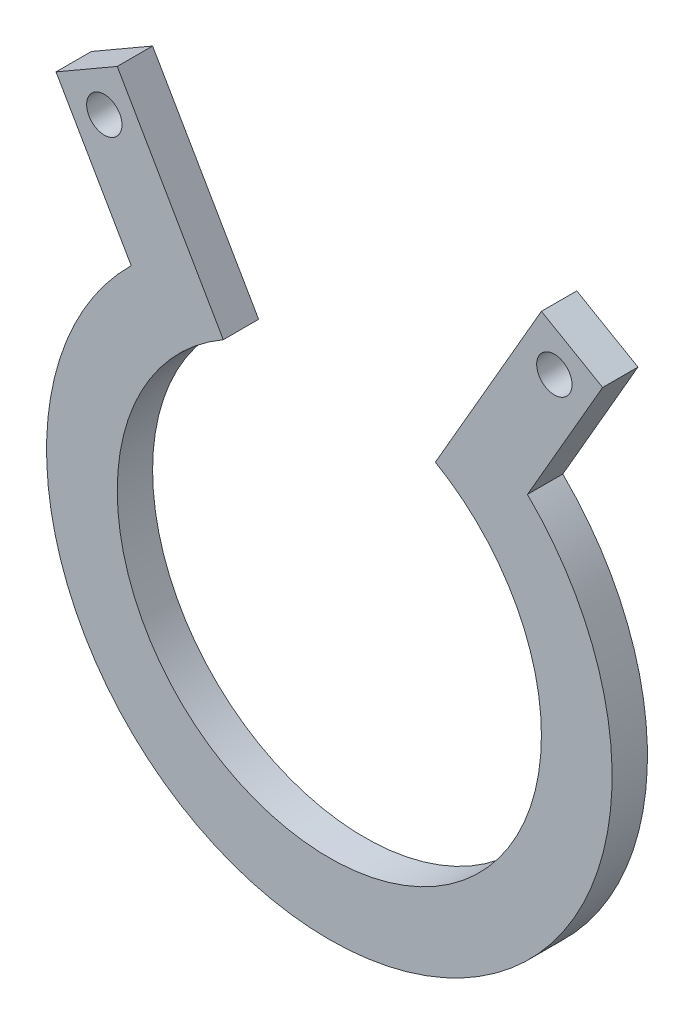
ISO-10303-21;
HEADER;
FILE_DESCRIPTION(('STEP AP214'),'2;1');
FILE_NAME('part.step','',(''),(''),'','','');
FILE_SCHEMA(('AUTOMOTIVE_DESIGN { 1 0 10303 214 1 1 1 1 }'));
ENDSEC;
DATA;
#1=APPLICATION_CONTEXT('core data for automotive mechanical design processes');
#2=APPLICATION_PROTOCOL_DEFINITION('international standard','automotive_design',2000,#1);
#3=PRODUCT_CONTEXT('',#1,'mechanical');
#4=PRODUCT('Part','Part','',(#3));
#5=PRODUCT_RELATED_PRODUCT_CATEGORY('part','',(#4));
#6=PRODUCT_DEFINITION_FORMATION('','',#4);
#7=PRODUCT_DEFINITION_CONTEXT('part definition',#1,'design');
#8=PRODUCT_DEFINITION('design','',#6,#7);
#9=PRODUCT_DEFINITION_SHAPE('','',#8);
#10=(LENGTH_UNIT() NAMED_UNIT(*) SI_UNIT(.MILLI.,.METRE.));
#11=(NAMED_UNIT(*) PLANE_ANGLE_UNIT() SI_UNIT($,.RADIAN.));
#12=(NAMED_UNIT(*) SI_UNIT($,.STERADIAN.) SOLID_ANGLE_UNIT());
#13=UNCERTAINTY_MEASURE_WITH_UNIT(LENGTH_MEASURE(1.E-05),#10,'distance_accuracy_value','');
#14=(GEOMETRIC_REPRESENTATION_CONTEXT(3) GLOBAL_UNCERTAINTY_ASSIGNED_CONTEXT((#13)) GLOBAL_UNIT_ASSIGNED_CONTEXT((#10,
#11,#12)) REPRESENTATION_CONTEXT('',''));
#15=CARTESIAN_POINT('',(0.,0.,0.));
#16=DIRECTION('',(0.,0.,1.));
#17=DIRECTION('',(1.,0.,0.));
#18=AXIS2_PLACEMENT_3D('',#15,#16,#17);
#19=CARTESIAN_POINT('',(0.,0.,3.175));
#20=DIRECTION('',(0.,0.,-1.));
#21=DIRECTION('',(-1.,0.,0.));
#22=AXIS2_PLACEMENT_3D('',#19,#20,#21);
#23=CYLINDRICAL_SURFACE('',#22,25.4);
#24=DIRECTION('',(0.,0.,1.));
#25=VECTOR('',#24,1.);
#26=CARTESIAN_POINT('',(17.7959834382398,18.1235474856855,-19.0153092118336));
#27=LINE('',#26,#25);
#28=CARTESIAN_POINT('',(17.7959834382398,18.1235474856855,0.));
#29=VERTEX_POINT('',#28);
#30=CARTESIAN_POINT('',(17.7959834382398,18.1235474856855,3.175));
#31=VERTEX_POINT('',#30);
#32=EDGE_CURVE('E64',#29,#31,#27,.T.);
#33=ORIENTED_EDGE('',*,*,#32,.T.);
#34=CARTESIAN_POINT('',(0.,0.,3.175));
#35=DIRECTION('',(0.,0.,1.));
#36=DIRECTION('',(1.,0.,0.));
#37=AXIS2_PLACEMENT_3D('',#34,#35,#36);
#38=CIRCLE('',#37,25.4);
#39=CARTESIAN_POINT('',(-17.7959834382398,18.1235474856855,3.175));
#40=VERTEX_POINT('',#39);
#41=EDGE_CURVE('E56',#40,#31,#38,.T.);
#42=ORIENTED_EDGE('',*,*,#41,.F.);
#43=DIRECTION('',(0.,0.,1.));
#44=VECTOR('',#43,1.);
#45=CARTESIAN_POINT('',(-17.7959834382398,18.1235474856855,-19.0153092118336));
#46=LINE('',#45,#44);
#47=CARTESIAN_POINT('',(-17.7959834382398,18.1235474856855,0.));
#48=VERTEX_POINT('',#47);
#49=EDGE_CURVE('E144',#48,#40,#46,.T.);
#50=ORIENTED_EDGE('',*,*,#49,.F.);
#51=CARTESIAN_POINT('',(0.,0.,0.));
#52=DIRECTION('',(0.,0.,1.));
#53=DIRECTION('',(1.,0.,0.));
#54=AXIS2_PLACEMENT_3D('',#51,#52,#53);
#55=CIRCLE('',#54,25.4);
#56=EDGE_CURVE('E69',#48,#29,#55,.T.);
#57=ORIENTED_EDGE('',*,*,#56,.T.);
#58=EDGE_LOOP('',(#33,#42,#50,#57));
#59=FACE_BOUND('',#58,.T.);
#60=ADVANCED_FACE('F48',(#59),#23,.T.);
#61=CARTESIAN_POINT('',(0.,0.,3.175));
#62=DIRECTION('',(0.,0.,-1.));
#63=DIRECTION('',(-1.,0.,0.));
#64=AXIS2_PLACEMENT_3D('',#61,#62,#63);
#65=CYLINDRICAL_SURFACE('',#64,19.05);
#66=DIRECTION('',(0.,0.,-1.));
#67=VECTOR('',#66,1.);
#68=CARTESIAN_POINT('',(9.52500000000003,16.4977839420935,3.175));
#69=LINE('',#68,#67);
#70=CARTESIAN_POINT('',(9.52500000000003,16.4977839420935,0.));
#71=VERTEX_POINT('',#70);
#72=CARTESIAN_POINT('',(9.52500000000002,16.4977839420935,3.175));
#73=VERTEX_POINT('',#72);
#74=EDGE_CURVE('E131',#71,#73,#69,.F.);
#75=ORIENTED_EDGE('',*,*,#74,.F.);
#76=CARTESIAN_POINT('',(0.,0.,0.));
#77=DIRECTION('',(0.,0.,1.));
#78=DIRECTION('',(1.,0.,0.));
#79=AXIS2_PLACEMENT_3D('',#76,#77,#78);
#80=CIRCLE('',#79,19.05);
#81=CARTESIAN_POINT('',(-9.52500000000003,16.4977839420935,0.));
#82=VERTEX_POINT('',#81);
#83=EDGE_CURVE('E51',#82,#71,#80,.T.);
#84=ORIENTED_EDGE('',*,*,#83,.F.);
#85=DIRECTION('',(0.,0.,-1.));
#86=VECTOR('',#85,1.);
#87=CARTESIAN_POINT('',(-9.52500000000003,16.4977839420935,3.175));
#88=LINE('',#87,#86);
#89=CARTESIAN_POINT('',(-9.52500000000003,16.4977839420935,3.175));
#90=VERTEX_POINT('',#89);
#91=EDGE_CURVE('E125',#90,#82,#88,.T.);
#92=ORIENTED_EDGE('',*,*,#91,.F.);
#93=CARTESIAN_POINT('',(0.,0.,3.175));
#94=DIRECTION('',(0.,0.,1.));
#95=DIRECTION('',(1.,0.,0.));
#96=AXIS2_PLACEMENT_3D('',#93,#94,#95);
#97=CIRCLE('',#96,19.05);
#98=EDGE_CURVE('E13',#90,#73,#97,.T.);
#99=ORIENTED_EDGE('',*,*,#98,.T.);
#100=EDGE_LOOP('',(#75,#84,#92,#99));
#101=FACE_BOUND('',#100,.T.);
#102=ADVANCED_FACE('F134',(#101),#65,.F.);
#103=CARTESIAN_POINT('',(0.,0.,3.175));
#104=DIRECTION('',(0.,0.,1.));
#105=DIRECTION('',(1.,0.,0.));
#106=AXIS2_PLACEMENT_3D('',#103,#104,#105);
#107=PLANE('',#106);
#108=DIRECTION('',(-0.500000000000001,-0.866025403784438,0.));
#109=VECTOR('',#108,1.);
#110=CARTESIAN_POINT('',(0.,0.,3.175));
#111=LINE('',#110,#109);
#112=CARTESIAN_POINT('',(19.0500000000001,32.9955678841871,3.175));
#113=VERTEX_POINT('',#112);
#114=EDGE_CURVE('E177',#113,#73,#111,.T.);
#115=ORIENTED_EDGE('',*,*,#114,.T.);
#116=ORIENTED_EDGE('',*,*,#98,.F.);
#117=DIRECTION('',(-0.500000000000001,0.866025403784438,0.));
#118=VECTOR('',#117,1.);
#119=CARTESIAN_POINT('',(0.,0.,3.175));
#120=LINE('',#119,#118);
#121=CARTESIAN_POINT('',(-19.0500000000001,32.9955678841871,3.175));
#122=VERTEX_POINT('',#121);
#123=EDGE_CURVE('E128',#90,#122,#120,.T.);
#124=ORIENTED_EDGE('',*,*,#123,.T.);
#125=DIRECTION('',(-0.866025403784438,-0.500000000000001,0.));
#126=VECTOR('',#125,1.);
#127=CARTESIAN_POINT('',(-19.05,32.9955678841871,3.175));
#128=LINE('',#127,#126);
#129=CARTESIAN_POINT('',(-24.5492613140312,29.8205678841871,3.175));
#130=VERTEX_POINT('',#129);
#131=EDGE_CURVE('E147',#122,#130,#128,.T.);
#132=ORIENTED_EDGE('',*,*,#131,.T.);
#133=DIRECTION('',(0.500000000000001,-0.866025403784438,0.));
#134=VECTOR('',#133,1.);
#135=CARTESIAN_POINT('',(-5.49926131403119,-3.17500000000001,3.175));
#136=LINE('',#135,#134);
#137=EDGE_CURVE('E157',#130,#40,#136,.T.);
#138=ORIENTED_EDGE('',*,*,#137,.T.);
#139=ORIENTED_EDGE('',*,*,#41,.T.);
#140=DIRECTION('',(-0.500000000000001,-0.866025403784438,0.));
#141=VECTOR('',#140,1.);
#142=CARTESIAN_POINT('',(5.49926131403119,-3.17500000000001,3.175));
#143=LINE('',#142,#141);
#144=CARTESIAN_POINT('',(24.5492613140312,29.8205678841871,3.175));
#145=VERTEX_POINT('',#144);
#146=EDGE_CURVE('E178',#145,#31,#143,.T.);
#147=ORIENTED_EDGE('',*,*,#146,.F.);
#148=DIRECTION('',(0.866025403784438,-0.500000000000001,0.));
#149=VECTOR('',#148,1.);
#150=CARTESIAN_POINT('',(19.05,32.9955678841871,3.175));
#151=LINE('',#150,#149);
#152=EDGE_CURVE('E170',#113,#145,#151,.T.);
#153=ORIENTED_EDGE('',*,*,#152,.F.);
#154=EDGE_LOOP('',(#115,#116,#124,#132,#138,#139,#147,#153));
#155=FACE_BOUND('',#154,.T.);
#156=CARTESIAN_POINT('',(-20.2121306570156,28.6584372271715,3.175));
#157=DIRECTION('',(0.,0.,1.));
#158=DIRECTION('',(1.,0.,0.));
#159=AXIS2_PLACEMENT_3D('',#156,#157,#158);
#160=CIRCLE('',#159,1.58749999999998);
#161=CARTESIAN_POINT('',(-18.6246306570157,28.6584372271715,3.175));
#162=VERTEX_POINT('',#161);
#163=EDGE_CURVE('E148',#162,#162,#160,.T.);
#164=ORIENTED_EDGE('',*,*,#163,.F.);
#165=EDGE_LOOP('',(#164));
#166=FACE_BOUND('',#165,.T.);
#167=CARTESIAN_POINT('',(20.2121306570156,28.6584372271715,3.175));
#168=DIRECTION('',(0.,0.,1.));
#169=DIRECTION('',(1.,0.,0.));
#170=AXIS2_PLACEMENT_3D('',#167,#168,#169);
#171=CIRCLE('',#170,1.58749999999998);
#172=CARTESIAN_POINT('',(21.7996306570156,28.6584372271715,3.175));
#173=VERTEX_POINT('',#172);
#174=EDGE_CURVE('E164',#173,#173,#171,.F.);
#175=ORIENTED_EDGE('',*,*,#174,.T.);
#176=EDGE_LOOP('',(#175));
#177=FACE_BOUND('',#176,.T.);
#178=ADVANCED_FACE('F192',(#155,#166,#177),#107,.T.);
#179=CARTESIAN_POINT('',(0.,0.,0.));
#180=DIRECTION('',(0.,0.,1.));
#181=DIRECTION('',(1.,0.,0.));
#182=AXIS2_PLACEMENT_3D('',#179,#180,#181);
#183=PLANE('',#182);
#184=ORIENTED_EDGE('',*,*,#83,.T.);
#185=DIRECTION('',(0.500000000000001,0.866025403784438,0.));
#186=VECTOR('',#185,1.);
#187=CARTESIAN_POINT('',(0.,0.,0.));
#188=LINE('',#187,#186);
#189=CARTESIAN_POINT('',(19.0500000000001,32.9955678841871,0.));
#190=VERTEX_POINT('',#189);
#191=EDGE_CURVE('E143',#71,#190,#188,.T.);
#192=ORIENTED_EDGE('',*,*,#191,.T.);
#193=DIRECTION('',(-0.866025403784438,0.500000000000001,0.));
#194=VECTOR('',#193,1.);
#195=CARTESIAN_POINT('',(19.05,32.9955678841871,0.));
#196=LINE('',#195,#194);
#197=CARTESIAN_POINT('',(24.5492613140312,29.8205678841871,0.));
#198=VERTEX_POINT('',#197);
#199=EDGE_CURVE('E171',#198,#190,#196,.T.);
#200=ORIENTED_EDGE('',*,*,#199,.F.);
#201=DIRECTION('',(0.500000000000001,0.866025403784438,0.));
#202=VECTOR('',#201,1.);
#203=CARTESIAN_POINT('',(5.49926131403119,-3.17500000000001,0.));
#204=LINE('',#203,#202);
#205=EDGE_CURVE('E166',#29,#198,#204,.T.);
#206=ORIENTED_EDGE('',*,*,#205,.F.);
#207=ORIENTED_EDGE('',*,*,#56,.F.);
#208=DIRECTION('',(-0.500000000000001,0.866025403784438,0.));
#209=VECTOR('',#208,1.);
#210=CARTESIAN_POINT('',(-5.49926131403119,-3.17500000000001,0.));
#211=LINE('',#210,#209);
#212=CARTESIAN_POINT('',(-24.5492613140312,29.8205678841871,0.));
#213=VERTEX_POINT('',#212);
#214=EDGE_CURVE('E122',#48,#213,#211,.T.);
#215=ORIENTED_EDGE('',*,*,#214,.T.);
#216=DIRECTION('',(0.866025403784438,0.500000000000001,0.));
#217=VECTOR('',#216,1.);
#218=CARTESIAN_POINT('',(-19.05,32.9955678841871,0.));
#219=LINE('',#218,#217);
#220=CARTESIAN_POINT('',(-19.0500000000001,32.9955678841871,0.));
#221=VERTEX_POINT('',#220);
#222=EDGE_CURVE('E119',#213,#221,#219,.T.);
#223=ORIENTED_EDGE('',*,*,#222,.T.);
#224=DIRECTION('',(0.500000000000001,-0.866025403784438,0.));
#225=VECTOR('',#224,1.);
#226=CARTESIAN_POINT('',(0.,0.,0.));
#227=LINE('',#226,#225);
#228=EDGE_CURVE('E113',#221,#82,#227,.T.);
#229=ORIENTED_EDGE('',*,*,#228,.T.);
#230=EDGE_LOOP('',(#184,#192,#200,#206,#207,#215,#223,#229));
#231=FACE_BOUND('',#230,.T.);
#232=CARTESIAN_POINT('',(-20.2121306570156,28.6584372271715,0.));
#233=DIRECTION('',(0.,0.,1.));
#234=DIRECTION('',(1.,0.,0.));
#235=AXIS2_PLACEMENT_3D('',#232,#233,#234);
#236=CIRCLE('',#235,1.58749999999998);
#237=CARTESIAN_POINT('',(-18.6246306570157,28.6584372271715,0.));
#238=VERTEX_POINT('',#237);
#239=EDGE_CURVE('E149',#238,#238,#236,.F.);
#240=ORIENTED_EDGE('',*,*,#239,.F.);
#241=EDGE_LOOP('',(#240));
#242=FACE_BOUND('',#241,.T.);
#243=CARTESIAN_POINT('',(20.2121306570156,28.6584372271715,0.));
#244=DIRECTION('',(0.,0.,1.));
#245=DIRECTION('',(1.,0.,0.));
#246=AXIS2_PLACEMENT_3D('',#243,#244,#245);
#247=CIRCLE('',#246,1.58749999999998);
#248=CARTESIAN_POINT('',(21.7996306570156,28.6584372271715,0.));
#249=VERTEX_POINT('',#248);
#250=EDGE_CURVE('E161',#249,#249,#247,.T.);
#251=ORIENTED_EDGE('',*,*,#250,.T.);
#252=EDGE_LOOP('',(#251));
#253=FACE_BOUND('',#252,.T.);
#254=ADVANCED_FACE('F115',(#231,#242,#253),#183,.F.);
#255=CARTESIAN_POINT('',(-19.05,32.9955678841871,-19.0153092118336));
#256=DIRECTION('',(-0.500000000000001,0.866025403784438,0.));
#257=DIRECTION('',(-0.866025403784438,-0.500000000000001,0.));
#258=AXIS2_PLACEMENT_3D('',#255,#256,#257);
#259=PLANE('',#258);
#260=ORIENTED_EDGE('',*,*,#222,.F.);
#261=DIRECTION('',(0.,0.,1.));
#262=VECTOR('',#261,1.);
#263=CARTESIAN_POINT('',(-24.5492613140312,29.8205678841871,-19.0153092118336));
#264=LINE('',#263,#262);
#265=EDGE_CURVE('E140',#213,#130,#264,.T.);
#266=ORIENTED_EDGE('',*,*,#265,.T.);
#267=ORIENTED_EDGE('',*,*,#131,.F.);
#268=DIRECTION('',(0.,0.,1.));
#269=VECTOR('',#268,1.);
#270=CARTESIAN_POINT('',(-19.0500000000001,32.9955678841871,-19.0153092118336));
#271=LINE('',#270,#269);
#272=EDGE_CURVE('E142',#221,#122,#271,.T.);
#273=ORIENTED_EDGE('',*,*,#272,.F.);
#274=EDGE_LOOP('',(#260,#266,#267,#273));
#275=FACE_BOUND('',#274,.T.);
#276=ADVANCED_FACE('F221',(#275),#259,.T.);
#277=CARTESIAN_POINT('',(0.,0.,-19.0153092118336));
#278=DIRECTION('',(0.866025403784438,0.500000000000001,0.));
#279=DIRECTION('',(-0.500000000000001,0.866025403784438,0.));
#280=AXIS2_PLACEMENT_3D('',#277,#278,#279);
#281=PLANE('',#280);
#282=ORIENTED_EDGE('',*,*,#228,.F.);
#283=ORIENTED_EDGE('',*,*,#272,.T.);
#284=ORIENTED_EDGE('',*,*,#123,.F.);
#285=ORIENTED_EDGE('',*,*,#91,.T.);
#286=EDGE_LOOP('',(#282,#283,#284,#285));
#287=FACE_BOUND('',#286,.T.);
#288=ADVANCED_FACE('F126',(#287),#281,.T.);
#289=CARTESIAN_POINT('',(-20.2121306570156,28.6584372271715,-19.0153092118336));
#290=DIRECTION('',(0.,0.,1.));
#291=DIRECTION('',(1.,0.,0.));
#292=AXIS2_PLACEMENT_3D('',#289,#290,#291);
#293=CYLINDRICAL_SURFACE('',#292,1.58749999999998);
#294=ORIENTED_EDGE('',*,*,#239,.T.);
#295=EDGE_LOOP('',(#294));
#296=FACE_BOUND('',#295,.T.);
#297=ORIENTED_EDGE('',*,*,#163,.T.);
#298=EDGE_LOOP('',(#297));
#299=FACE_BOUND('',#298,.T.);
#300=ADVANCED_FACE('F228',(#296,#299),#293,.F.);
#301=CARTESIAN_POINT('',(-5.49926131403119,-3.17500000000001,-19.0153092118336));
#302=DIRECTION('',(-0.866025403784438,-0.500000000000001,0.));
#303=DIRECTION('',(0.500000000000001,-0.866025403784438,0.));
#304=AXIS2_PLACEMENT_3D('',#301,#302,#303);
#305=PLANE('',#304);
#306=ORIENTED_EDGE('',*,*,#214,.F.);
#307=ORIENTED_EDGE('',*,*,#49,.T.);
#308=ORIENTED_EDGE('',*,*,#137,.F.);
#309=ORIENTED_EDGE('',*,*,#265,.F.);
#310=EDGE_LOOP('',(#306,#307,#308,#309));
#311=FACE_BOUND('',#310,.T.);
#312=ADVANCED_FACE('F209',(#311),#305,.T.);
#313=CARTESIAN_POINT('',(19.05,32.9955678841871,-19.0153092118336));
#314=DIRECTION('',(-0.500000000000001,-0.866025403784438,0.));
#315=DIRECTION('',(0.866025403784438,-0.500000000000001,0.));
#316=AXIS2_PLACEMENT_3D('',#313,#314,#315);
#317=PLANE('',#316);
#318=DIRECTION('',(0.,0.,1.));
#319=VECTOR('',#318,1.);
#320=CARTESIAN_POINT('',(24.5492613140312,29.8205678841871,-19.0153092118336));
#321=LINE('',#320,#319);
#322=EDGE_CURVE('E169',#198,#145,#321,.T.);
#323=ORIENTED_EDGE('',*,*,#322,.F.);
#324=ORIENTED_EDGE('',*,*,#199,.T.);
#325=DIRECTION('',(0.,0.,1.));
#326=VECTOR('',#325,1.);
#327=CARTESIAN_POINT('',(19.0500000000001,32.9955678841871,-19.0153092118336));
#328=LINE('',#327,#326);
#329=EDGE_CURVE('E174',#190,#113,#328,.T.);
#330=ORIENTED_EDGE('',*,*,#329,.T.);
#331=ORIENTED_EDGE('',*,*,#152,.T.);
#332=EDGE_LOOP('',(#323,#324,#330,#331));
#333=FACE_BOUND('',#332,.T.);
#334=ADVANCED_FACE('F198',(#333),#317,.F.);
#335=CARTESIAN_POINT('',(5.49926131403119,-3.17500000000001,-19.0153092118336));
#336=DIRECTION('',(-0.866025403784438,0.500000000000001,0.));
#337=DIRECTION('',(-0.500000000000001,-0.866025403784438,0.));
#338=AXIS2_PLACEMENT_3D('',#335,#336,#337);
#339=PLANE('',#338);
#340=ORIENTED_EDGE('',*,*,#32,.F.);
#341=ORIENTED_EDGE('',*,*,#205,.T.);
#342=ORIENTED_EDGE('',*,*,#322,.T.);
#343=ORIENTED_EDGE('',*,*,#146,.T.);
#344=EDGE_LOOP('',(#340,#341,#342,#343));
#345=FACE_BOUND('',#344,.T.);
#346=ADVANCED_FACE('F200',(#345),#339,.F.);
#347=CARTESIAN_POINT('',(0.,0.,-19.0153092118336));
#348=DIRECTION('',(-0.866025403784438,0.500000000000001,0.));
#349=DIRECTION('',(-0.500000000000001,-0.866025403784438,0.));
#350=AXIS2_PLACEMENT_3D('',#347,#348,#349);
#351=PLANE('',#350);
#352=ORIENTED_EDGE('',*,*,#191,.F.);
#353=ORIENTED_EDGE('',*,*,#74,.T.);
#354=ORIENTED_EDGE('',*,*,#114,.F.);
#355=ORIENTED_EDGE('',*,*,#329,.F.);
#356=EDGE_LOOP('',(#352,#353,#354,#355));
#357=FACE_BOUND('',#356,.T.);
#358=ADVANCED_FACE('F189',(#357),#351,.T.);
#359=CARTESIAN_POINT('',(20.2121306570156,28.6584372271715,-19.0153092118336));
#360=DIRECTION('',(0.,0.,1.));
#361=DIRECTION('',(1.,0.,0.));
#362=AXIS2_PLACEMENT_3D('',#359,#360,#361);
#363=CYLINDRICAL_SURFACE('',#362,1.58749999999998);
#364=ORIENTED_EDGE('',*,*,#250,.F.);
#365=EDGE_LOOP('',(#364));
#366=FACE_BOUND('',#365,.T.);
#367=ORIENTED_EDGE('',*,*,#174,.F.);
#368=EDGE_LOOP('',(#367));
#369=FACE_BOUND('',#368,.T.);
#370=ADVANCED_FACE('F207',(#366,#369),#363,.F.);
#371=CLOSED_SHELL('',(#60,#102,#178,#254,#276,#288,#300,#312,#334,#346,#358,#370));
#372=MANIFOLD_SOLID_BREP('B2',#371);
#373=ADVANCED_BREP_SHAPE_REPRESENTATION('',(#18,#372),#14);
#374=SHAPE_DEFINITION_REPRESENTATION(#9,#373);
ENDSEC;
END-ISO-10303-21;
